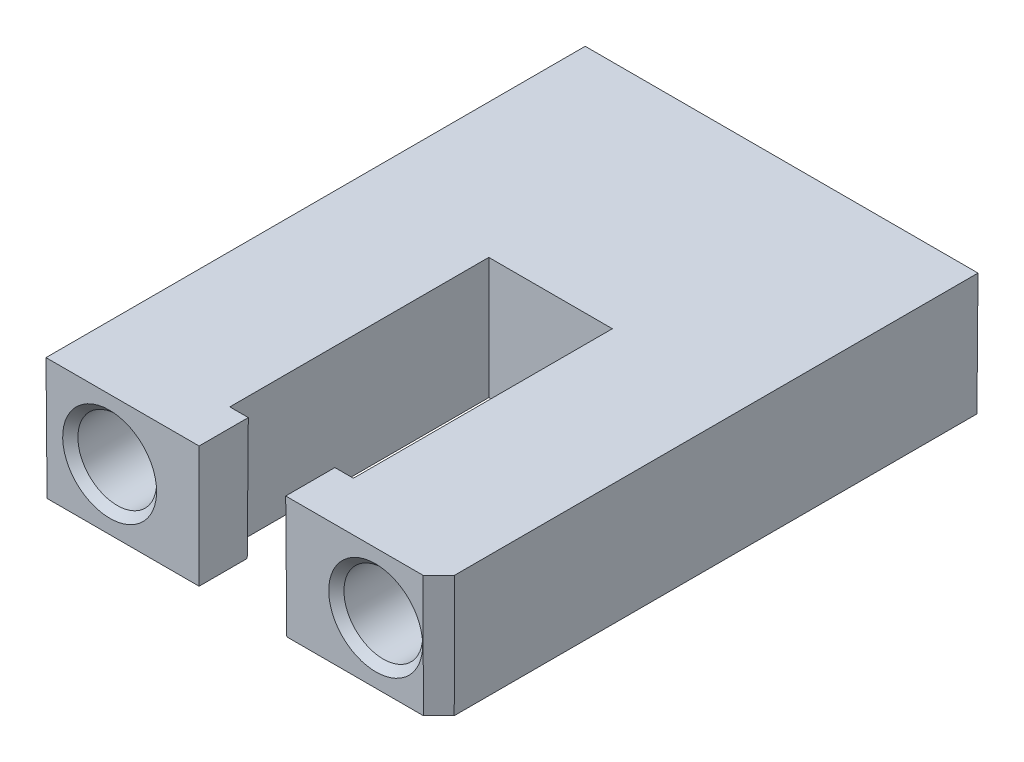
ISO-10303-21;
HEADER;
FILE_DESCRIPTION(('STEP AP214'),'2;1');
FILE_NAME('part.step','',(''),(''),'','','');
FILE_SCHEMA(('AUTOMOTIVE_DESIGN { 1 0 10303 214 1 1 1 1 }'));
ENDSEC;
DATA;
#1=APPLICATION_CONTEXT('core data for automotive mechanical design processes');
#2=APPLICATION_PROTOCOL_DEFINITION('international standard','automotive_design',2000,#1);
#3=PRODUCT_CONTEXT('',#1,'mechanical');
#4=PRODUCT('Part','Part','',(#3));
#5=PRODUCT_RELATED_PRODUCT_CATEGORY('part','',(#4));
#6=PRODUCT_DEFINITION_FORMATION('','',#4);
#7=PRODUCT_DEFINITION_CONTEXT('part definition',#1,'design');
#8=PRODUCT_DEFINITION('design','',#6,#7);
#9=PRODUCT_DEFINITION_SHAPE('','',#8);
#10=(LENGTH_UNIT() NAMED_UNIT(*) SI_UNIT(.MILLI.,.METRE.));
#11=(NAMED_UNIT(*) PLANE_ANGLE_UNIT() SI_UNIT($,.RADIAN.));
#12=(NAMED_UNIT(*) SI_UNIT($,.STERADIAN.) SOLID_ANGLE_UNIT());
#13=UNCERTAINTY_MEASURE_WITH_UNIT(LENGTH_MEASURE(1.E-05),#10,'distance_accuracy_value','');
#14=(GEOMETRIC_REPRESENTATION_CONTEXT(3) GLOBAL_UNCERTAINTY_ASSIGNED_CONTEXT((#13)) GLOBAL_UNIT_ASSIGNED_CONTEXT((#10,
#11,#12)) REPRESENTATION_CONTEXT('',''));
#15=CARTESIAN_POINT('',(0.,0.,0.));
#16=DIRECTION('',(0.,0.,1.));
#17=DIRECTION('',(1.,0.,0.));
#18=AXIS2_PLACEMENT_3D('',#15,#16,#17);
#19=CARTESIAN_POINT('',(-12.6746,3.937,0.));
#20=DIRECTION('',(0.,-0.00436330928474658,0.999990480720734));
#21=DIRECTION('',(0.,-0.999990480720734,-0.00436330928474658));
#22=AXIS2_PLACEMENT_3D('',#19,#20,#21);
#23=PLANE('',#22);
#24=CARTESIAN_POINT('',(-8.5852,0.0132247892107933,-0.0171208077862457));
#25=DIRECTION('',(0.,-0.00436330928474658,0.999990480720734));
#26=DIRECTION('',(0.,0.999990480720734,0.00436330928474658));
#27=AXIS2_PLACEMENT_3D('',#24,#25,#26);
#28=ELLIPSE('',#27,3.03090804427385,3.030850339879);
#29=CARTESIAN_POINT('',(-8.5852,3.04410398142455,-0.00389601857545247));
#30=VERTEX_POINT('',#29);
#31=EDGE_CURVE('E42',#30,#30,#28,.F.);
#32=ORIENTED_EDGE('',*,*,#31,.T.);
#33=EDGE_LOOP('',(#32));
#34=FACE_BOUND('',#33,.T.);
#35=DIRECTION('',(-0.00436326774997777,-0.999980961713314,-0.00436326774997774));
#36=VECTOR('',#35,1.);
#37=CARTESIAN_POINT('',(-2.794,3.937,0.));
#38=LINE('',#37,#36);
#39=CARTESIAN_POINT('',(-2.8283570243622,-3.937,-0.0343570243622042));
#40=VERTEX_POINT('',#39);
#41=CARTESIAN_POINT('',(-2.794,3.937,0.));
#42=VERTEX_POINT('',#41);
#43=EDGE_CURVE('E124',#40,#42,#38,.F.);
#44=ORIENTED_EDGE('',*,*,#43,.T.);
#45=DIRECTION('',(-1.,0.,0.));
#46=VECTOR('',#45,1.);
#47=CARTESIAN_POINT('',(-12.6746,3.937,0.));
#48=LINE('',#47,#46);
#49=CARTESIAN_POINT('',(-12.6746,3.937,0.));
#50=VERTEX_POINT('',#49);
#51=EDGE_CURVE('E119',#42,#50,#48,.T.);
#52=ORIENTED_EDGE('',*,*,#51,.T.);
#53=DIRECTION('',(0.00436326774997771,-0.999980961713314,-0.00436326774997774));
#54=VECTOR('',#53,1.);
#55=CARTESIAN_POINT('',(-12.6746,3.937,0.));
#56=LINE('',#55,#54);
#57=CARTESIAN_POINT('',(-12.6402429756378,-3.937,-0.0343570243622042));
#58=VERTEX_POINT('',#57);
#59=EDGE_CURVE('E123',#50,#58,#56,.T.);
#60=ORIENTED_EDGE('',*,*,#59,.T.);
#61=DIRECTION('',(1.,0.,0.));
#62=VECTOR('',#61,1.);
#63=CARTESIAN_POINT('',(-12.6746,-3.937,-0.0343570243622042));
#64=LINE('',#63,#62);
#65=EDGE_CURVE('E128',#58,#40,#64,.T.);
#66=ORIENTED_EDGE('',*,*,#65,.T.);
#67=EDGE_LOOP('',(#44,#52,#60,#66));
#68=FACE_BOUND('',#67,.T.);
#69=ADVANCED_FACE('F38',(#34,#68),#23,.T.);
#70=CARTESIAN_POINT('',(-12.6746,3.937,-34.798));
#71=DIRECTION('',(-0.999990480720734,-0.00436330928474655,0.));
#72=DIRECTION('',(0.00436330928474655,-0.999990480720734,0.));
#73=AXIS2_PLACEMENT_3D('',#70,#71,#72);
#74=PLANE('',#73);
#75=ORIENTED_EDGE('',*,*,#59,.F.);
#76=DIRECTION('',(0.,0.,1.));
#77=VECTOR('',#76,1.);
#78=CARTESIAN_POINT('',(-12.6746,3.937,-34.798));
#79=LINE('',#78,#77);
#80=CARTESIAN_POINT('',(-12.6746,3.937,-34.798));
#81=VERTEX_POINT('',#80);
#82=EDGE_CURVE('E130',#81,#50,#79,.T.);
#83=ORIENTED_EDGE('',*,*,#82,.F.);
#84=DIRECTION('',(-0.00436326774997771,0.999980961713314,-0.00436326774997774));
#85=VECTOR('',#84,1.);
#86=CARTESIAN_POINT('',(-12.6746,3.937,-34.798));
#87=LINE('',#86,#85);
#88=CARTESIAN_POINT('',(-12.6402429756378,-3.937,-34.7636429756378));
#89=VERTEX_POINT('',#88);
#90=EDGE_CURVE('E156',#81,#89,#87,.F.);
#91=ORIENTED_EDGE('',*,*,#90,.T.);
#92=DIRECTION('',(0.,0.,1.));
#93=VECTOR('',#92,1.);
#94=CARTESIAN_POINT('',(-12.6402429756378,-3.937,-34.798));
#95=LINE('',#94,#93);
#96=EDGE_CURVE('E141',#89,#58,#95,.T.);
#97=ORIENTED_EDGE('',*,*,#96,.T.);
#98=EDGE_LOOP('',(#75,#83,#91,#97));
#99=FACE_BOUND('',#98,.T.);
#100=ADVANCED_FACE('F140',(#99),#74,.T.);
#101=CARTESIAN_POINT('',(-12.6746,3.937,-34.798));
#102=DIRECTION('',(0.,1.,0.));
#103=DIRECTION('',(-1.,0.,0.));
#104=AXIS2_PLACEMENT_3D('',#101,#102,#103);
#105=PLANE('',#104);
#106=CARTESIAN_POINT('',(11.6586,3.937,0.));
#107=VERTEX_POINT('',#106);
#108=CARTESIAN_POINT('',(2.794,3.937,0.));
#109=VERTEX_POINT('',#108);
#110=EDGE_CURVE('E127',#107,#109,#48,.T.);
#111=ORIENTED_EDGE('',*,*,#110,.F.);
#112=DIRECTION('',(-0.707106781186544,0.,0.707106781186551));
#113=VECTOR('',#112,1.);
#114=CARTESIAN_POINT('',(16.8910000000001,3.937,-5.23240000000018));
#115=LINE('',#114,#113);
#116=CARTESIAN_POINT('',(12.6746,3.937,-1.01600000000001));
#117=VERTEX_POINT('',#116);
#118=EDGE_CURVE('E64',#107,#117,#115,.F.);
#119=ORIENTED_EDGE('',*,*,#118,.T.);
#120=DIRECTION('',(0.,0.,1.));
#121=VECTOR('',#120,1.);
#122=CARTESIAN_POINT('',(12.6746,3.937,-34.798));
#123=LINE('',#122,#121);
#124=CARTESIAN_POINT('',(12.6746,3.937,-34.798));
#125=VERTEX_POINT('',#124);
#126=EDGE_CURVE('E109',#125,#117,#123,.T.);
#127=ORIENTED_EDGE('',*,*,#126,.F.);
#128=DIRECTION('',(-1.,0.,0.));
#129=VECTOR('',#128,1.);
#130=CARTESIAN_POINT('',(-12.6746,3.937,-34.798));
#131=LINE('',#130,#129);
#132=EDGE_CURVE('E133',#125,#81,#131,.T.);
#133=ORIENTED_EDGE('',*,*,#132,.T.);
#134=ORIENTED_EDGE('',*,*,#82,.T.);
#135=ORIENTED_EDGE('',*,*,#51,.F.);
#136=DIRECTION('',(0.,0.,1.));
#137=VECTOR('',#136,1.);
#138=CARTESIAN_POINT('',(-2.794,3.937,0.));
#139=LINE('',#138,#137);
#140=CARTESIAN_POINT('',(-2.794,3.937,-3.175));
#141=VERTEX_POINT('',#140);
#142=EDGE_CURVE('E167',#141,#42,#139,.T.);
#143=ORIENTED_EDGE('',*,*,#142,.F.);
#144=DIRECTION('',(1.,0.,0.));
#145=VECTOR('',#144,1.);
#146=CARTESIAN_POINT('',(-2.794,3.937,-3.175));
#147=LINE('',#146,#145);
#148=CARTESIAN_POINT('',(-3.9878,3.937,-3.175));
#149=VERTEX_POINT('',#148);
#150=EDGE_CURVE('E259',#149,#141,#147,.T.);
#151=ORIENTED_EDGE('',*,*,#150,.F.);
#152=DIRECTION('',(0.,0.,1.));
#153=VECTOR('',#152,1.);
#154=CARTESIAN_POINT('',(-3.9878,3.937,-3.175));
#155=LINE('',#154,#153);
#156=CARTESIAN_POINT('',(-3.9878,3.937,-19.8882));
#157=VERTEX_POINT('',#156);
#158=EDGE_CURVE('E264',#157,#149,#155,.T.);
#159=ORIENTED_EDGE('',*,*,#158,.F.);
#160=DIRECTION('',(-1.,0.,0.));
#161=VECTOR('',#160,1.);
#162=CARTESIAN_POINT('',(-3.9878,3.937,-19.8882));
#163=LINE('',#162,#161);
#164=CARTESIAN_POINT('',(3.9878,3.937,-19.8882));
#165=VERTEX_POINT('',#164);
#166=EDGE_CURVE('E305',#165,#157,#163,.T.);
#167=ORIENTED_EDGE('',*,*,#166,.F.);
#168=DIRECTION('',(0.,0.,-1.));
#169=VECTOR('',#168,1.);
#170=CARTESIAN_POINT('',(3.9878,3.937,-19.8882));
#171=LINE('',#170,#169);
#172=CARTESIAN_POINT('',(3.9878,3.937,-3.175));
#173=VERTEX_POINT('',#172);
#174=EDGE_CURVE('E295',#173,#165,#171,.T.);
#175=ORIENTED_EDGE('',*,*,#174,.F.);
#176=DIRECTION('',(1.,0.,0.));
#177=VECTOR('',#176,1.);
#178=CARTESIAN_POINT('',(3.9878,3.937,-3.175));
#179=LINE('',#178,#177);
#180=CARTESIAN_POINT('',(2.794,3.937,-3.175));
#181=VERTEX_POINT('',#180);
#182=EDGE_CURVE('E291',#181,#173,#179,.T.);
#183=ORIENTED_EDGE('',*,*,#182,.F.);
#184=DIRECTION('',(0.,0.,-1.));
#185=VECTOR('',#184,1.);
#186=CARTESIAN_POINT('',(2.794,3.937,-3.175));
#187=LINE('',#186,#185);
#188=EDGE_CURVE('E287',#109,#181,#187,.T.);
#189=ORIENTED_EDGE('',*,*,#188,.F.);
#190=EDGE_LOOP('',(#111,#119,#127,#133,#134,#135,#143,#151,#159,#167,#175,#183,#189));
#191=FACE_BOUND('',#190,.T.);
#192=ADVANCED_FACE('F131',(#191),#105,.T.);
#193=CARTESIAN_POINT('',(12.6746,3.937,-34.798));
#194=DIRECTION('',(0.999990480720734,-0.00436330928474661,0.));
#195=DIRECTION('',(0.00436330928474661,0.999990480720734,0.));
#196=AXIS2_PLACEMENT_3D('',#193,#194,#195);
#197=PLANE('',#196);
#198=ORIENTED_EDGE('',*,*,#126,.T.);
#199=DIRECTION('',(-0.00436330215842261,-0.999988847497943,-0.00180733893075041));
#200=VECTOR('',#199,1.);
#201=CARTESIAN_POINT('',(12.6743335963014,3.87594515716325,-1.01611034802503));
#202=LINE('',#201,#200);
#203=CARTESIAN_POINT('',(12.6402429756378,-3.937,-1.03023114545361));
#204=VERTEX_POINT('',#203);
#205=EDGE_CURVE('E48',#117,#204,#202,.T.);
#206=ORIENTED_EDGE('',*,*,#205,.T.);
#207=DIRECTION('',(0.,0.,1.));
#208=VECTOR('',#207,1.);
#209=CARTESIAN_POINT('',(12.6402429756378,-3.937,-34.798));
#210=LINE('',#209,#208);
#211=CARTESIAN_POINT('',(12.6402429756378,-3.937,-34.7636429756378));
#212=VERTEX_POINT('',#211);
#213=EDGE_CURVE('E105',#212,#204,#210,.T.);
#214=ORIENTED_EDGE('',*,*,#213,.F.);
#215=DIRECTION('',(-0.00436326774997777,-0.999980961713314,0.00436326774997774));
#216=VECTOR('',#215,1.);
#217=CARTESIAN_POINT('',(12.6741173992571,3.82639675888857,-34.7975173992571));
#218=LINE('',#217,#216);
#219=EDGE_CURVE('E160',#212,#125,#218,.F.);
#220=ORIENTED_EDGE('',*,*,#219,.T.);
#221=EDGE_LOOP('',(#198,#206,#214,#220));
#222=FACE_BOUND('',#221,.T.);
#223=ADVANCED_FACE('F362',(#222),#197,.T.);
#224=CARTESIAN_POINT('',(-12.6746,-3.937,-34.798));
#225=DIRECTION('',(0.,-1.,0.));
#226=DIRECTION('',(0.,0.,-1.));
#227=AXIS2_PLACEMENT_3D('',#224,#225,#226);
#228=PLANE('',#227);
#229=ORIENTED_EDGE('',*,*,#213,.T.);
#230=DIRECTION('',(-0.707106781186544,0.,0.707106781186551));
#231=VECTOR('',#230,1.);
#232=CARTESIAN_POINT('',(16.8667059150922,-3.937,-5.25669408490809));
#233=LINE('',#232,#231);
#234=CARTESIAN_POINT('',(11.6443688545464,-3.937,-0.0343570243622042));
#235=VERTEX_POINT('',#234);
#236=EDGE_CURVE('E11',#204,#235,#233,.T.);
#237=ORIENTED_EDGE('',*,*,#236,.T.);
#238=DIRECTION('',(1.,0.,0.));
#239=VECTOR('',#238,1.);
#240=CARTESIAN_POINT('',(-12.6746,-3.937,-0.0343570243622042));
#241=LINE('',#240,#239);
#242=CARTESIAN_POINT('',(2.8283570243622,-3.937,-0.0343570243622042));
#243=VERTEX_POINT('',#242);
#244=EDGE_CURVE('E144',#243,#235,#241,.T.);
#245=ORIENTED_EDGE('',*,*,#244,.F.);
#246=DIRECTION('',(0.,0.,1.));
#247=VECTOR('',#246,1.);
#248=CARTESIAN_POINT('',(2.8283570243622,-3.937,-3.175));
#249=LINE('',#248,#247);
#250=CARTESIAN_POINT('',(2.8283570243622,-3.937,-3.1406429756378));
#251=VERTEX_POINT('',#250);
#252=EDGE_CURVE('E162',#243,#251,#249,.F.);
#253=ORIENTED_EDGE('',*,*,#252,.T.);
#254=DIRECTION('',(-1.,0.,0.));
#255=VECTOR('',#254,1.);
#256=CARTESIAN_POINT('',(3.9878,-3.937,-3.14064297563779));
#257=LINE('',#256,#255);
#258=CARTESIAN_POINT('',(4.0221570243622,-3.937,-3.14064297563779));
#259=VERTEX_POINT('',#258);
#260=EDGE_CURVE('E166',#251,#259,#257,.F.);
#261=ORIENTED_EDGE('',*,*,#260,.T.);
#262=DIRECTION('',(0.,0.,1.));
#263=VECTOR('',#262,1.);
#264=CARTESIAN_POINT('',(4.0221570243622,-3.937,-19.8882));
#265=LINE('',#264,#263);
#266=CARTESIAN_POINT('',(4.0221570243622,-3.937,-19.9225570243622));
#267=VERTEX_POINT('',#266);
#268=EDGE_CURVE('E171',#259,#267,#265,.F.);
#269=ORIENTED_EDGE('',*,*,#268,.T.);
#270=DIRECTION('',(1.,0.,0.));
#271=VECTOR('',#270,1.);
#272=CARTESIAN_POINT('',(-3.9878,-3.937,-19.9225570243622));
#273=LINE('',#272,#271);
#274=CARTESIAN_POINT('',(-4.0221570243622,-3.937,-19.9225570243622));
#275=VERTEX_POINT('',#274);
#276=EDGE_CURVE('E175',#267,#275,#273,.F.);
#277=ORIENTED_EDGE('',*,*,#276,.T.);
#278=DIRECTION('',(0.,0.,-1.));
#279=VECTOR('',#278,1.);
#280=CARTESIAN_POINT('',(-4.0221570243622,-3.937,-3.175));
#281=LINE('',#280,#279);
#282=CARTESIAN_POINT('',(-4.0221570243622,-3.937,-3.14064297563779));
#283=VERTEX_POINT('',#282);
#284=EDGE_CURVE('E179',#275,#283,#281,.F.);
#285=ORIENTED_EDGE('',*,*,#284,.T.);
#286=DIRECTION('',(-1.,0.,0.));
#287=VECTOR('',#286,1.);
#288=CARTESIAN_POINT('',(-2.794,-3.937,-3.1406429756378));
#289=LINE('',#288,#287);
#290=CARTESIAN_POINT('',(-2.8283570243622,-3.937,-3.1406429756378));
#291=VERTEX_POINT('',#290);
#292=EDGE_CURVE('E183',#283,#291,#289,.F.);
#293=ORIENTED_EDGE('',*,*,#292,.T.);
#294=DIRECTION('',(0.,0.,-1.));
#295=VECTOR('',#294,1.);
#296=CARTESIAN_POINT('',(-2.8283570243622,-3.937,0.));
#297=LINE('',#296,#295);
#298=EDGE_CURVE('E187',#291,#40,#297,.F.);
#299=ORIENTED_EDGE('',*,*,#298,.T.);
#300=ORIENTED_EDGE('',*,*,#65,.F.);
#301=ORIENTED_EDGE('',*,*,#96,.F.);
#302=DIRECTION('',(-1.,0.,0.));
#303=VECTOR('',#302,1.);
#304=CARTESIAN_POINT('',(-12.6746,-3.937,-34.7636429756378));
#305=LINE('',#304,#303);
#306=EDGE_CURVE('E159',#89,#212,#305,.F.);
#307=ORIENTED_EDGE('',*,*,#306,.T.);
#308=EDGE_LOOP('',(#229,#237,#245,#253,#261,#269,#277,#285,#293,#299,#300,#301,#307));
#309=FACE_BOUND('',#308,.T.);
#310=ADVANCED_FACE('F359',(#309),#228,.T.);
#311=CARTESIAN_POINT('',(-12.6746,3.937,-34.798));
#312=DIRECTION('',(0.,-0.00436330928474658,-0.999990480720734));
#313=DIRECTION('',(0.,0.999990480720734,-0.00436330928474658));
#314=AXIS2_PLACEMENT_3D('',#311,#312,#313);
#315=PLANE('',#314);
#316=ORIENTED_EDGE('',*,*,#90,.F.);
#317=ORIENTED_EDGE('',*,*,#132,.F.);
#318=ORIENTED_EDGE('',*,*,#219,.F.);
#319=ORIENTED_EDGE('',*,*,#306,.F.);
#320=EDGE_LOOP('',(#316,#317,#318,#319));
#321=FACE_BOUND('',#320,.T.);
#322=ADVANCED_FACE('F357',(#321),#315,.T.);
#323=CARTESIAN_POINT('',(-12.6746,3.937,0.));
#324=DIRECTION('',(0.,-0.00436330928474658,0.999990480720734));
#325=DIRECTION('',(0.,-0.999990480720734,-0.00436330928474658));
#326=AXIS2_PLACEMENT_3D('',#323,#324,#325);
#327=PLANE('',#326);
#328=CARTESIAN_POINT('',(8.5852,0.0132247892107933,-0.0171208077862457));
#329=DIRECTION('',(0.,-0.00436330928474658,0.999990480720734));
#330=DIRECTION('',(0.,0.999990480720734,0.00436330928474658));
#331=AXIS2_PLACEMENT_3D('',#328,#329,#330);
#332=ELLIPSE('',#331,3.03090804427385,3.030850339879);
#333=CARTESIAN_POINT('',(8.5852,3.04410398142455,-0.00389601857545247));
#334=VERTEX_POINT('',#333);
#335=EDGE_CURVE('E200',#334,#334,#332,.F.);
#336=ORIENTED_EDGE('',*,*,#335,.T.);
#337=EDGE_LOOP('',(#336));
#338=FACE_BOUND('',#337,.T.);
#339=ORIENTED_EDGE('',*,*,#244,.T.);
#340=DIRECTION('',(0.00180733893075047,0.999988847497943,0.00436330215842257));
#341=VECTOR('',#340,1.);
#342=CARTESIAN_POINT('',(11.6585205162346,3.89302215079879,-0.000191890784404803));
#343=LINE('',#342,#341);
#344=EDGE_CURVE('E220',#235,#107,#343,.T.);
#345=ORIENTED_EDGE('',*,*,#344,.T.);
#346=ORIENTED_EDGE('',*,*,#110,.T.);
#347=DIRECTION('',(0.00436326774997771,-0.999980961713314,-0.00436326774997774));
#348=VECTOR('',#347,1.);
#349=CARTESIAN_POINT('',(2.79370550716191,4.00449235855397,0.000294492838087554));
#350=LINE('',#349,#348);
#351=EDGE_CURVE('E191',#243,#109,#350,.F.);
#352=ORIENTED_EDGE('',*,*,#351,.F.);
#353=EDGE_LOOP('',(#339,#345,#346,#352));
#354=FACE_BOUND('',#353,.T.);
#355=ADVANCED_FACE('F277',(#338,#354),#327,.T.);
#356=CARTESIAN_POINT('',(-2.794,3.937,0.));
#357=DIRECTION('',(0.999990480720734,-0.00436330928474661,0.));
#358=DIRECTION('',(0.00436330928474661,0.999990480720734,0.));
#359=AXIS2_PLACEMENT_3D('',#356,#357,#358);
#360=PLANE('',#359);
#361=ORIENTED_EDGE('',*,*,#142,.T.);
#362=ORIENTED_EDGE('',*,*,#43,.F.);
#363=ORIENTED_EDGE('',*,*,#298,.F.);
#364=DIRECTION('',(0.00436326774997777,0.999980961713314,-0.00436326774997774));
#365=VECTOR('',#364,1.);
#366=CARTESIAN_POINT('',(-2.79406044598483,3.92314688863835,-3.17493955401517));
#367=LINE('',#366,#365);
#368=EDGE_CURVE('E152',#291,#141,#367,.T.);
#369=ORIENTED_EDGE('',*,*,#368,.T.);
#370=EDGE_LOOP('',(#361,#362,#363,#369));
#371=FACE_BOUND('',#370,.T.);
#372=ADVANCED_FACE('F254',(#371),#360,.T.);
#373=CARTESIAN_POINT('',(-2.794,3.937,-3.175));
#374=DIRECTION('',(0.,-0.00436330928474658,-0.999990480720734));
#375=DIRECTION('',(0.,0.999990480720734,-0.00436330928474658));
#376=AXIS2_PLACEMENT_3D('',#373,#374,#375);
#377=PLANE('',#376);
#378=ORIENTED_EDGE('',*,*,#150,.T.);
#379=ORIENTED_EDGE('',*,*,#368,.F.);
#380=ORIENTED_EDGE('',*,*,#292,.F.);
#381=DIRECTION('',(0.00436326774997777,0.999980961713314,-0.00436326774997774));
#382=VECTOR('',#381,1.);
#383=CARTESIAN_POINT('',(-3.9878,3.937,-3.175));
#384=LINE('',#383,#382);
#385=EDGE_CURVE('E244',#283,#149,#384,.T.);
#386=ORIENTED_EDGE('',*,*,#385,.T.);
#387=EDGE_LOOP('',(#378,#379,#380,#386));
#388=FACE_BOUND('',#387,.T.);
#389=ADVANCED_FACE('F260',(#388),#377,.T.);
#390=CARTESIAN_POINT('',(-3.9878,3.937,-3.175));
#391=DIRECTION('',(0.999990480720734,-0.00436330928474661,0.));
#392=DIRECTION('',(0.00436330928474661,0.999990480720734,0.));
#393=AXIS2_PLACEMENT_3D('',#390,#391,#392);
#394=PLANE('',#393);
#395=ORIENTED_EDGE('',*,*,#158,.T.);
#396=ORIENTED_EDGE('',*,*,#385,.F.);
#397=ORIENTED_EDGE('',*,*,#284,.F.);
#398=DIRECTION('',(0.00436326774997777,0.999980961713314,0.00436326774997774));
#399=VECTOR('',#398,1.);
#400=CARTESIAN_POINT('',(-3.9878,3.937,-19.8882));
#401=LINE('',#400,#399);
#402=EDGE_CURVE('E240',#275,#157,#401,.T.);
#403=ORIENTED_EDGE('',*,*,#402,.T.);
#404=EDGE_LOOP('',(#395,#396,#397,#403));
#405=FACE_BOUND('',#404,.T.);
#406=ADVANCED_FACE('F40',(#405),#394,.T.);
#407=CARTESIAN_POINT('',(-3.9878,3.937,-19.8882));
#408=DIRECTION('',(0.,-0.00436330928474658,0.999990480720734));
#409=DIRECTION('',(0.,-0.999990480720734,-0.00436330928474658));
#410=AXIS2_PLACEMENT_3D('',#407,#408,#409);
#411=PLANE('',#410);
#412=ORIENTED_EDGE('',*,*,#166,.T.);
#413=ORIENTED_EDGE('',*,*,#402,.F.);
#414=ORIENTED_EDGE('',*,*,#276,.F.);
#415=DIRECTION('',(-0.00436326774997771,0.999980961713314,0.00436326774997774));
#416=VECTOR('',#415,1.);
#417=CARTESIAN_POINT('',(3.9878,3.937,-19.8882));
#418=LINE('',#417,#416);
#419=EDGE_CURVE('E237',#267,#165,#418,.T.);
#420=ORIENTED_EDGE('',*,*,#419,.T.);
#421=EDGE_LOOP('',(#412,#413,#414,#420));
#422=FACE_BOUND('',#421,.T.);
#423=ADVANCED_FACE('F377',(#422),#411,.T.);
#424=CARTESIAN_POINT('',(3.9878,3.937,-19.8882));
#425=DIRECTION('',(-0.999990480720734,-0.00436330928474655,0.));
#426=DIRECTION('',(0.00436330928474655,-0.999990480720734,0.));
#427=AXIS2_PLACEMENT_3D('',#424,#425,#426);
#428=PLANE('',#427);
#429=ORIENTED_EDGE('',*,*,#174,.T.);
#430=ORIENTED_EDGE('',*,*,#419,.F.);
#431=ORIENTED_EDGE('',*,*,#268,.F.);
#432=DIRECTION('',(-0.00436326774997771,0.999980961713314,-0.00436326774997774));
#433=VECTOR('',#432,1.);
#434=CARTESIAN_POINT('',(3.9878,3.937,-3.175));
#435=LINE('',#434,#433);
#436=EDGE_CURVE('E233',#259,#173,#435,.T.);
#437=ORIENTED_EDGE('',*,*,#436,.T.);
#438=EDGE_LOOP('',(#429,#430,#431,#437));
#439=FACE_BOUND('',#438,.T.);
#440=ADVANCED_FACE('F370',(#439),#428,.T.);
#441=CARTESIAN_POINT('',(3.9878,3.937,-3.175));
#442=DIRECTION('',(0.,-0.00436330928474658,-0.999990480720734));
#443=DIRECTION('',(0.,0.999990480720734,-0.00436330928474658));
#444=AXIS2_PLACEMENT_3D('',#441,#442,#443);
#445=PLANE('',#444);
#446=ORIENTED_EDGE('',*,*,#182,.T.);
#447=ORIENTED_EDGE('',*,*,#436,.F.);
#448=ORIENTED_EDGE('',*,*,#260,.F.);
#449=DIRECTION('',(-0.00436326774997771,0.999980961713314,-0.00436326774997774));
#450=VECTOR('',#449,1.);
#451=CARTESIAN_POINT('',(2.7940227276903,3.93179123012802,-3.1749772723097));
#452=LINE('',#451,#450);
#453=EDGE_CURVE('E229',#251,#181,#452,.T.);
#454=ORIENTED_EDGE('',*,*,#453,.T.);
#455=EDGE_LOOP('',(#446,#447,#448,#454));
#456=FACE_BOUND('',#455,.T.);
#457=ADVANCED_FACE('F367',(#456),#445,.T.);
#458=CARTESIAN_POINT('',(2.794,3.937,-3.175));
#459=DIRECTION('',(-0.999990480720734,-0.00436330928474655,0.));
#460=DIRECTION('',(0.00436330928474655,-0.999990480720734,0.));
#461=AXIS2_PLACEMENT_3D('',#458,#459,#460);
#462=PLANE('',#461);
#463=ORIENTED_EDGE('',*,*,#188,.T.);
#464=ORIENTED_EDGE('',*,*,#453,.F.);
#465=ORIENTED_EDGE('',*,*,#252,.F.);
#466=ORIENTED_EDGE('',*,*,#351,.T.);
#467=EDGE_LOOP('',(#463,#464,#465,#466));
#468=FACE_BOUND('',#467,.T.);
#469=ADVANCED_FACE('F286',(#468),#462,.T.);
#470=CARTESIAN_POINT('',(8.5852,0.,-12.7));
#471=DIRECTION('',(0.,0.,1.));
#472=DIRECTION('',(1.,0.,0.));
#473=AXIS2_PLACEMENT_3D('',#470,#471,#472);
#474=CONICAL_SURFACE('',#473,2.54,1.02974425867665);
#475=CARTESIAN_POINT('',(8.5852,0.,-14.22618597233));
#476=VERTEX_POINT('',#475);
#477=VERTEX_LOOP('',#476);
#478=FACE_BOUND('',#477,.T.);
#479=CARTESIAN_POINT('',(8.5852,0.,-12.7));
#480=DIRECTION('',(0.,0.,1.));
#481=DIRECTION('',(1.,0.,0.));
#482=AXIS2_PLACEMENT_3D('',#479,#480,#481);
#483=CIRCLE('',#482,2.54);
#484=CARTESIAN_POINT('',(11.1252,0.,-12.7));
#485=VERTEX_POINT('',#484);
#486=EDGE_CURVE('E292',#485,#485,#483,.T.);
#487=ORIENTED_EDGE('',*,*,#486,.T.);
#488=EDGE_LOOP('',(#487));
#489=FACE_BOUND('',#488,.T.);
#490=ADVANCED_FACE('F374',(#478,#489),#474,.F.);
#491=CARTESIAN_POINT('',(8.5852,0.,0.));
#492=DIRECTION('',(0.,0.,1.));
#493=DIRECTION('',(1.,0.,0.));
#494=AXIS2_PLACEMENT_3D('',#491,#492,#493);
#495=CYLINDRICAL_SURFACE('',#494,2.54);
#496=CARTESIAN_POINT('',(8.5852,0.,-0.507999999999995));
#497=DIRECTION('',(0.,0.,1.));
#498=DIRECTION('',(1.,0.,0.));
#499=AXIS2_PLACEMENT_3D('',#496,#497,#498);
#500=CIRCLE('',#499,2.54);
#501=CARTESIAN_POINT('',(11.1252,0.,-0.507999999999995));
#502=VERTEX_POINT('',#501);
#503=EDGE_CURVE('E138',#502,#502,#500,.T.);
#504=ORIENTED_EDGE('',*,*,#503,.T.);
#505=EDGE_LOOP('',(#504));
#506=FACE_BOUND('',#505,.T.);
#507=ORIENTED_EDGE('',*,*,#486,.F.);
#508=EDGE_LOOP('',(#507));
#509=FACE_BOUND('',#508,.T.);
#510=ADVANCED_FACE('F331',(#506,#509),#495,.F.);
#511=CARTESIAN_POINT('',(-8.5852,0.,-12.7));
#512=DIRECTION('',(0.,0.,1.));
#513=DIRECTION('',(1.,0.,0.));
#514=AXIS2_PLACEMENT_3D('',#511,#512,#513);
#515=CONICAL_SURFACE('',#514,2.54,1.02974425867665);
#516=CARTESIAN_POINT('',(-8.5852,0.,-14.22618597233));
#517=VERTEX_POINT('',#516);
#518=VERTEX_LOOP('',#517);
#519=FACE_BOUND('',#518,.T.);
#520=CARTESIAN_POINT('',(-8.5852,0.,-12.7));
#521=DIRECTION('',(0.,0.,1.));
#522=DIRECTION('',(1.,0.,0.));
#523=AXIS2_PLACEMENT_3D('',#520,#521,#522);
#524=CIRCLE('',#523,2.54);
#525=CARTESIAN_POINT('',(-6.0452,0.,-12.7));
#526=VERTEX_POINT('',#525);
#527=EDGE_CURVE('E299',#526,#526,#524,.T.);
#528=ORIENTED_EDGE('',*,*,#527,.T.);
#529=EDGE_LOOP('',(#528));
#530=FACE_BOUND('',#529,.T.);
#531=ADVANCED_FACE('F327',(#519,#530),#515,.F.);
#532=CARTESIAN_POINT('',(-8.5852,0.,0.));
#533=DIRECTION('',(0.,0.,1.));
#534=DIRECTION('',(1.,0.,0.));
#535=AXIS2_PLACEMENT_3D('',#532,#533,#534);
#536=CYLINDRICAL_SURFACE('',#535,2.54);
#537=CARTESIAN_POINT('',(-8.5852,0.,-0.507999999999995));
#538=DIRECTION('',(0.,0.,1.));
#539=DIRECTION('',(1.,0.,0.));
#540=AXIS2_PLACEMENT_3D('',#537,#538,#539);
#541=CIRCLE('',#540,2.54);
#542=CARTESIAN_POINT('',(-6.0452,0.,-0.507999999999995));
#543=VERTEX_POINT('',#542);
#544=EDGE_CURVE('E203',#543,#543,#541,.T.);
#545=ORIENTED_EDGE('',*,*,#544,.T.);
#546=EDGE_LOOP('',(#545));
#547=FACE_BOUND('',#546,.T.);
#548=ORIENTED_EDGE('',*,*,#527,.F.);
#549=EDGE_LOOP('',(#548));
#550=FACE_BOUND('',#549,.T.);
#551=ADVANCED_FACE('F330',(#547,#550),#536,.F.);
#552=CARTESIAN_POINT('',(8.5852,0.,-0.507999999999995));
#553=DIRECTION('',(0.,0.,1.));
#554=DIRECTION('',(1.,0.,0.));
#555=AXIS2_PLACEMENT_3D('',#552,#553,#554);
#556=CONICAL_SURFACE('',#555,2.54,0.785398163397453);
#557=ORIENTED_EDGE('',*,*,#335,.F.);
#558=EDGE_LOOP('',(#557));
#559=FACE_BOUND('',#558,.T.);
#560=ORIENTED_EDGE('',*,*,#503,.F.);
#561=EDGE_LOOP('',(#560));
#562=FACE_BOUND('',#561,.T.);
#563=ADVANCED_FACE('F337',(#559,#562),#556,.F.);
#564=CARTESIAN_POINT('',(-8.5852,0.,-0.507999999999995));
#565=DIRECTION('',(0.,0.,1.));
#566=DIRECTION('',(1.,0.,0.));
#567=AXIS2_PLACEMENT_3D('',#564,#565,#566);
#568=CONICAL_SURFACE('',#567,2.54,0.785398163397453);
#569=ORIENTED_EDGE('',*,*,#31,.F.);
#570=EDGE_LOOP('',(#569));
#571=FACE_BOUND('',#570,.T.);
#572=ORIENTED_EDGE('',*,*,#544,.F.);
#573=EDGE_LOOP('',(#572));
#574=FACE_BOUND('',#573,.T.);
#575=ADVANCED_FACE('F343',(#571,#574),#568,.F.);
#576=CARTESIAN_POINT('',(16.8910000000001,3.937,-5.23240000000018));
#577=DIRECTION('',(0.707100050039631,-0.0043633092847466,0.707100050039623));
#578=DIRECTION('',(0.707106781186544,0.,-0.707106781186551));
#579=AXIS2_PLACEMENT_3D('',#576,#577,#578);
#580=PLANE('',#579);
#581=ORIENTED_EDGE('',*,*,#236,.F.);
#582=ORIENTED_EDGE('',*,*,#205,.F.);
#583=ORIENTED_EDGE('',*,*,#118,.F.);
#584=ORIENTED_EDGE('',*,*,#344,.F.);
#585=EDGE_LOOP('',(#581,#582,#583,#584));
#586=FACE_BOUND('',#585,.T.);
#587=ADVANCED_FACE('F391',(#586),#580,.T.);
#588=CLOSED_SHELL('',(#69,#100,#192,#223,#310,#322,#355,#372,#389,#406,#423,#440,#457,#469,#490,
#510,#531,#551,#563,#575,#587));
#589=MANIFOLD_SOLID_BREP('B2',#588);
#590=ADVANCED_BREP_SHAPE_REPRESENTATION('',(#18,#589),#14);
#591=SHAPE_DEFINITION_REPRESENTATION(#9,#590);
ENDSEC;
END-ISO-10303-21;
